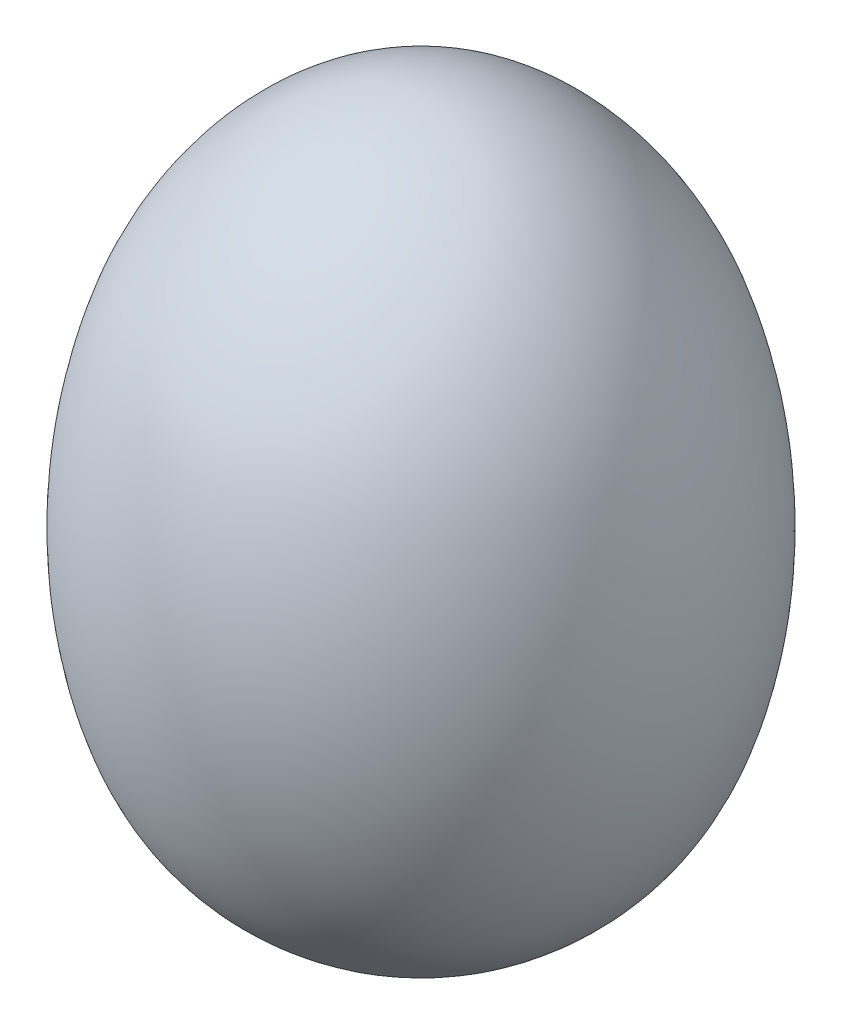
ISO-10303-21;
HEADER;
FILE_DESCRIPTION(('STEP AP214'),'2;1');
FILE_NAME('part.step','',(''),(''),'','','');
FILE_SCHEMA(('AUTOMOTIVE_DESIGN { 1 0 10303 214 1 1 1 1 }'));
ENDSEC;
DATA;
#1=APPLICATION_CONTEXT('core data for automotive mechanical design processes');
#2=APPLICATION_PROTOCOL_DEFINITION('international standard','automotive_design',2000,#1);
#3=PRODUCT_CONTEXT('',#1,'mechanical');
#4=PRODUCT('Part','Part','',(#3));
#5=PRODUCT_RELATED_PRODUCT_CATEGORY('part','',(#4));
#6=PRODUCT_DEFINITION_FORMATION('','',#4);
#7=PRODUCT_DEFINITION_CONTEXT('part definition',#1,'design');
#8=PRODUCT_DEFINITION('design','',#6,#7);
#9=PRODUCT_DEFINITION_SHAPE('','',#8);
#10=(LENGTH_UNIT() NAMED_UNIT(*) SI_UNIT(.MILLI.,.METRE.));
#11=(NAMED_UNIT(*) PLANE_ANGLE_UNIT() SI_UNIT($,.RADIAN.));
#12=(NAMED_UNIT(*) SI_UNIT($,.STERADIAN.) SOLID_ANGLE_UNIT());
#13=UNCERTAINTY_MEASURE_WITH_UNIT(LENGTH_MEASURE(1.E-05),#10,'distance_accuracy_value','');
#14=(GEOMETRIC_REPRESENTATION_CONTEXT(3) GLOBAL_UNCERTAINTY_ASSIGNED_CONTEXT((#13)) GLOBAL_UNIT_ASSIGNED_CONTEXT((#10,
#11,#12)) REPRESENTATION_CONTEXT('',''));
#15=CARTESIAN_POINT('',(0.,0.,0.));
#16=DIRECTION('',(0.,0.,1.));
#17=DIRECTION('',(1.,0.,0.));
#18=AXIS2_PLACEMENT_3D('',#15,#16,#17);
#19=CARTESIAN_POINT('',(0.,58.2420647101429,0.));
#20=CARTESIAN_POINT('',(-8.98856786341889,58.2023053373453,0.));
#21=CARTESIAN_POINT('',(-16.6271589198069,49.9901046628988,0.));
#22=CARTESIAN_POINT('',(-21.844245477611,34.338431417596,0.));
#23=CARTESIAN_POINT('',(-22.5274617023299,22.4237763890322,0.));
#24=CARTESIAN_POINT('',(-16.4850790042965,5.77177196757037,0.));
#25=CARTESIAN_POINT('',(-6.80435110744525,0.178148044668667,0.));
#26=CARTESIAN_POINT('',(0.,0.,0.));
#27=B_SPLINE_CURVE_WITH_KNOTS('',3,(#19,#20,#21,#22,#23,#24,#25,#26),.UNSPECIFIED.,.F.,.F.,(4,1,
1,1,1,4),(0.,0.326023228085821,0.347663923046899,0.623966047190836,0.753219263074718,1.),.UNSPECIFIED.);
#28=CARTESIAN_POINT('',(0.,58.2420647101429,0.));
#29=DIRECTION('',(0.,1.,0.));
#30=AXIS1_PLACEMENT('',#28,#29);
#31=SURFACE_OF_REVOLUTION('',#27,#30);
#32=CARTESIAN_POINT('',(0.,0.,0.));
#33=VERTEX_POINT('',#32);
#34=VERTEX_LOOP('',#33);
#35=FACE_BOUND('',#34,.T.);
#36=CARTESIAN_POINT('',(0.,58.2420647101429,0.));
#37=VERTEX_POINT('',#36);
#38=VERTEX_LOOP('',#37);
#39=FACE_BOUND('',#38,.T.);
#40=ADVANCED_FACE('F31',(#35,#39),#31,.F.);
#41=CLOSED_SHELL('',(#40));
#42=MANIFOLD_SOLID_BREP('B2',#41);
#43=ADVANCED_BREP_SHAPE_REPRESENTATION('',(#18,#42),#14);
#44=SHAPE_DEFINITION_REPRESENTATION(#9,#43);
ENDSEC;
END-ISO-10303-21;
